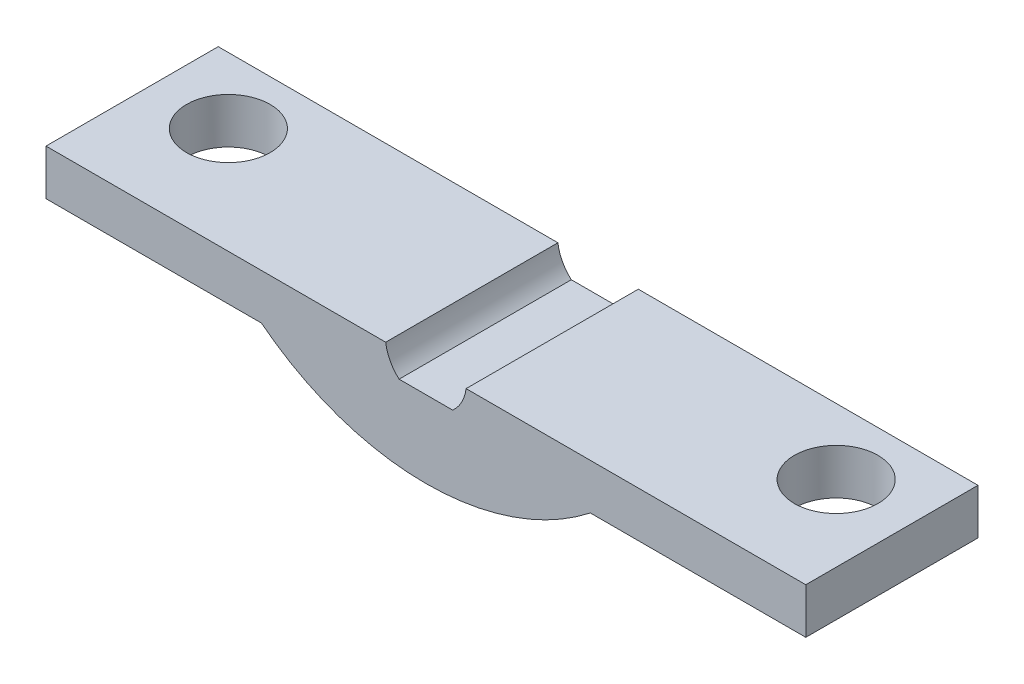
ISO-10303-21;
HEADER;
FILE_DESCRIPTION(('STEP AP214'),'2;1');
FILE_NAME('part.step','',(''),(''),'','','');
FILE_SCHEMA(('AUTOMOTIVE_DESIGN { 1 0 10303 214 1 1 1 1 }'));
ENDSEC;
DATA;
#1=APPLICATION_CONTEXT('core data for automotive mechanical design processes');
#2=APPLICATION_PROTOCOL_DEFINITION('international standard','automotive_design',2000,#1);
#3=PRODUCT_CONTEXT('',#1,'mechanical');
#4=PRODUCT('Part','Part','',(#3));
#5=PRODUCT_RELATED_PRODUCT_CATEGORY('part','',(#4));
#6=PRODUCT_DEFINITION_FORMATION('','',#4);
#7=PRODUCT_DEFINITION_CONTEXT('part definition',#1,'design');
#8=PRODUCT_DEFINITION('design','',#6,#7);
#9=PRODUCT_DEFINITION_SHAPE('','',#8);
#10=(LENGTH_UNIT() NAMED_UNIT(*) SI_UNIT(.MILLI.,.METRE.));
#11=(NAMED_UNIT(*) PLANE_ANGLE_UNIT() SI_UNIT($,.RADIAN.));
#12=(NAMED_UNIT(*) SI_UNIT($,.STERADIAN.) SOLID_ANGLE_UNIT());
#13=UNCERTAINTY_MEASURE_WITH_UNIT(LENGTH_MEASURE(1.E-05),#10,'distance_accuracy_value','');
#14=(GEOMETRIC_REPRESENTATION_CONTEXT(3) GLOBAL_UNCERTAINTY_ASSIGNED_CONTEXT((#13)) GLOBAL_UNIT_ASSIGNED_CONTEXT((#10,
#11,#12)) REPRESENTATION_CONTEXT('',''));
#15=CARTESIAN_POINT('',(0.,0.,0.));
#16=DIRECTION('',(0.,0.,1.));
#17=DIRECTION('',(1.,0.,0.));
#18=AXIS2_PLACEMENT_3D('',#15,#16,#17);
#19=CARTESIAN_POINT('',(0.,31.4655203588068,-111.672646407854));
#20=DIRECTION('',(0.,0.,1.));
#21=DIRECTION('',(1.,0.,0.));
#22=AXIS2_PLACEMENT_3D('',#19,#20,#21);
#23=CYLINDRICAL_SURFACE('',#22,52.6655203587927);
#24=CARTESIAN_POINT('',(0.,31.4655203588068,-33.9999999999999));
#25=DIRECTION('',(0.,0.,1.));
#26=DIRECTION('',(1.,0.,0.));
#27=AXIS2_PLACEMENT_3D('',#24,#25,#26);
#28=CIRCLE('',#27,52.6655203587927);
#29=CARTESIAN_POINT('',(32.4694880778216,-9.99999999999976,-33.9999999999999));
#30=VERTEX_POINT('',#29);
#31=CARTESIAN_POINT('',(-32.4694880778215,-9.99999999999999,-33.9999999999999));
#32=VERTEX_POINT('',#31);
#33=EDGE_CURVE('E52',#30,#32,#28,.F.);
#34=ORIENTED_EDGE('',*,*,#33,.F.);
#35=DIRECTION('',(0.,0.,1.));
#36=VECTOR('',#35,1.);
#37=CARTESIAN_POINT('',(32.4694880778216,-9.99999999999976,-111.672646407854));
#38=LINE('',#37,#36);
#39=CARTESIAN_POINT('',(32.4694880778216,-9.99999999999976,0.));
#40=VERTEX_POINT('',#39);
#41=EDGE_CURVE('E207',#30,#40,#38,.T.);
#42=ORIENTED_EDGE('',*,*,#41,.T.);
#43=CARTESIAN_POINT('',(0.,31.4655203588068,0.));
#44=DIRECTION('',(0.,0.,1.));
#45=DIRECTION('',(-1.,0.,0.));
#46=AXIS2_PLACEMENT_3D('',#43,#44,#45);
#47=CIRCLE('',#46,52.6655203587927);
#48=CARTESIAN_POINT('',(-32.4694880778215,-9.99999999999999,0.));
#49=VERTEX_POINT('',#48);
#50=EDGE_CURVE('E178',#49,#40,#47,.T.);
#51=ORIENTED_EDGE('',*,*,#50,.F.);
#52=DIRECTION('',(0.,0.,1.));
#53=VECTOR('',#52,1.);
#54=CARTESIAN_POINT('',(-32.4694880778215,-9.99999999999999,-111.672646407854));
#55=LINE('',#54,#53);
#56=EDGE_CURVE('E162',#32,#49,#55,.T.);
#57=ORIENTED_EDGE('',*,*,#56,.F.);
#58=EDGE_LOOP('',(#34,#42,#51,#57));
#59=FACE_BOUND('',#58,.T.);
#60=ADVANCED_FACE('F44',(#59),#23,.T.);
#61=CARTESIAN_POINT('',(-32.4694880778215,-9.99999999999999,-111.672646407854));
#62=DIRECTION('',(0.,-1.,0.));
#63=DIRECTION('',(1.,0.,0.));
#64=AXIS2_PLACEMENT_3D('',#61,#62,#63);
#65=PLANE('',#64);
#66=CARTESIAN_POINT('',(-60.,-9.99999999999999,-21.));
#67=DIRECTION('',(0.,-1.,0.));
#68=DIRECTION('',(1.,0.,0.));
#69=AXIS2_PLACEMENT_3D('',#66,#67,#68);
#70=CIRCLE('',#69,8.25);
#71=CARTESIAN_POINT('',(-51.75,-9.99999999999999,-21.));
#72=VERTEX_POINT('',#71);
#73=EDGE_CURVE('E154',#72,#72,#70,.T.);
#74=ORIENTED_EDGE('',*,*,#73,.F.);
#75=EDGE_LOOP('',(#74));
#76=FACE_BOUND('',#75,.T.);
#77=DIRECTION('',(-1.,0.,0.));
#78=VECTOR('',#77,1.);
#79=CARTESIAN_POINT('',(-32.4694880778215,-9.99999999999999,-33.9999999999999));
#80=LINE('',#79,#78);
#81=CARTESIAN_POINT('',(-75.,-9.99999999999999,-33.9999999999999));
#82=VERTEX_POINT('',#81);
#83=EDGE_CURVE('E165',#32,#82,#80,.T.);
#84=ORIENTED_EDGE('',*,*,#83,.F.);
#85=ORIENTED_EDGE('',*,*,#56,.T.);
#86=DIRECTION('',(1.,0.,0.));
#87=VECTOR('',#86,1.);
#88=CARTESIAN_POINT('',(-32.4694880778215,-9.99999999999999,0.));
#89=LINE('',#88,#87);
#90=CARTESIAN_POINT('',(-75.,-9.99999999999999,0.));
#91=VERTEX_POINT('',#90);
#92=EDGE_CURVE('E175',#91,#49,#89,.T.);
#93=ORIENTED_EDGE('',*,*,#92,.F.);
#94=DIRECTION('',(0.,0.,1.));
#95=VECTOR('',#94,1.);
#96=CARTESIAN_POINT('',(-75.,-9.99999999999999,-111.672646407854));
#97=LINE('',#96,#95);
#98=EDGE_CURVE('E181',#82,#91,#97,.T.);
#99=ORIENTED_EDGE('',*,*,#98,.F.);
#100=EDGE_LOOP('',(#84,#85,#93,#99));
#101=FACE_BOUND('',#100,.T.);
#102=ADVANCED_FACE('F201',(#76,#101),#65,.T.);
#103=CARTESIAN_POINT('',(-75.,-0.99999999999999,-111.672646407854));
#104=DIRECTION('',(-1.,0.,0.));
#105=DIRECTION('',(0.,0.,1.));
#106=AXIS2_PLACEMENT_3D('',#103,#104,#105);
#107=PLANE('',#106);
#108=DIRECTION('',(0.,1.,0.));
#109=VECTOR('',#108,1.);
#110=CARTESIAN_POINT('',(-75.,-0.99999999999999,-33.9999999999999));
#111=LINE('',#110,#109);
#112=CARTESIAN_POINT('',(-75.,-0.99999999999999,-33.9999999999999));
#113=VERTEX_POINT('',#112);
#114=EDGE_CURVE('E64',#82,#113,#111,.T.);
#115=ORIENTED_EDGE('',*,*,#114,.F.);
#116=ORIENTED_EDGE('',*,*,#98,.T.);
#117=DIRECTION('',(0.,-1.,0.));
#118=VECTOR('',#117,1.);
#119=CARTESIAN_POINT('',(-75.,-0.99999999999999,0.));
#120=LINE('',#119,#118);
#121=CARTESIAN_POINT('',(-75.,-0.99999999999999,0.));
#122=VERTEX_POINT('',#121);
#123=EDGE_CURVE('E172',#122,#91,#120,.T.);
#124=ORIENTED_EDGE('',*,*,#123,.F.);
#125=DIRECTION('',(0.,0.,1.));
#126=VECTOR('',#125,1.);
#127=CARTESIAN_POINT('',(-75.,-0.99999999999999,-111.672646407854));
#128=LINE('',#127,#126);
#129=EDGE_CURVE('E183',#113,#122,#128,.T.);
#130=ORIENTED_EDGE('',*,*,#129,.F.);
#131=EDGE_LOOP('',(#115,#116,#124,#130));
#132=FACE_BOUND('',#131,.T.);
#133=ADVANCED_FACE('F197',(#132),#107,.T.);
#134=CARTESIAN_POINT('',(-7.9372539331829,-0.999999999999999,-111.672646407854));
#135=DIRECTION('',(0.,1.,0.));
#136=DIRECTION('',(-1.,0.,0.));
#137=AXIS2_PLACEMENT_3D('',#134,#135,#136);
#138=PLANE('',#137);
#139=CARTESIAN_POINT('',(-60.,-0.99999999999999,-21.));
#140=DIRECTION('',(0.,1.,0.));
#141=DIRECTION('',(-1.,0.,0.));
#142=AXIS2_PLACEMENT_3D('',#139,#140,#141);
#143=CIRCLE('',#142,8.25);
#144=CARTESIAN_POINT('',(-68.25,-0.999999999999989,-21.));
#145=VERTEX_POINT('',#144);
#146=EDGE_CURVE('E130',#145,#145,#143,.F.);
#147=ORIENTED_EDGE('',*,*,#146,.T.);
#148=EDGE_LOOP('',(#147));
#149=FACE_BOUND('',#148,.T.);
#150=DIRECTION('',(1.,0.,0.));
#151=VECTOR('',#150,1.);
#152=CARTESIAN_POINT('',(-7.9372539331829,-0.999999999999999,-33.9999999999999));
#153=LINE('',#152,#151);
#154=CARTESIAN_POINT('',(-7.9372539331829,-0.999999999999999,-33.9999999999999));
#155=VERTEX_POINT('',#154);
#156=EDGE_CURVE('E59',#113,#155,#153,.T.);
#157=ORIENTED_EDGE('',*,*,#156,.F.);
#158=ORIENTED_EDGE('',*,*,#129,.T.);
#159=DIRECTION('',(-1.,0.,0.));
#160=VECTOR('',#159,1.);
#161=CARTESIAN_POINT('',(-7.9372539331829,-0.999999999999999,0.));
#162=LINE('',#161,#160);
#163=CARTESIAN_POINT('',(-7.9372539331829,-0.999999999999999,0.));
#164=VERTEX_POINT('',#163);
#165=EDGE_CURVE('E169',#164,#122,#162,.T.);
#166=ORIENTED_EDGE('',*,*,#165,.F.);
#167=DIRECTION('',(0.,0.,1.));
#168=VECTOR('',#167,1.);
#169=CARTESIAN_POINT('',(-7.9372539331829,-0.999999999999999,-111.672646407854));
#170=LINE('',#169,#168);
#171=EDGE_CURVE('E185',#155,#164,#170,.T.);
#172=ORIENTED_EDGE('',*,*,#171,.F.);
#173=EDGE_LOOP('',(#157,#158,#166,#172));
#174=FACE_BOUND('',#173,.T.);
#175=ADVANCED_FACE('F191',(#149,#174),#138,.T.);
#176=CARTESIAN_POINT('',(0.,0.,-111.672646407854));
#177=DIRECTION('',(0.,0.,1.));
#178=DIRECTION('',(1.,0.,0.));
#179=AXIS2_PLACEMENT_3D('',#176,#177,#178);
#180=CYLINDRICAL_SURFACE('',#179,7.99999999998921);
#181=CARTESIAN_POINT('',(0.,0.,-33.9999999999999));
#182=DIRECTION('',(0.,0.,1.));
#183=DIRECTION('',(1.,0.,0.));
#184=AXIS2_PLACEMENT_3D('',#181,#182,#183);
#185=CIRCLE('',#184,7.99999999998921);
#186=CARTESIAN_POINT('',(-5.29150262213566,-5.9999999999799,-33.9999999999999));
#187=VERTEX_POINT('',#186);
#188=EDGE_CURVE('E160',#155,#187,#185,.T.);
#189=ORIENTED_EDGE('',*,*,#188,.F.);
#190=ORIENTED_EDGE('',*,*,#171,.T.);
#191=CARTESIAN_POINT('',(0.,0.,0.));
#192=DIRECTION('',(0.,0.,-1.));
#193=DIRECTION('',(-1.,0.,0.));
#194=AXIS2_PLACEMENT_3D('',#191,#192,#193);
#195=CIRCLE('',#194,7.99999999998921);
#196=CARTESIAN_POINT('',(-5.29150262213566,-5.9999999999799,0.));
#197=VERTEX_POINT('',#196);
#198=EDGE_CURVE('E129',#197,#164,#195,.T.);
#199=ORIENTED_EDGE('',*,*,#198,.F.);
#200=DIRECTION('',(0.,0.,1.));
#201=VECTOR('',#200,1.);
#202=CARTESIAN_POINT('',(-5.29150262213566,-5.9999999999799,-111.672646407854));
#203=LINE('',#202,#201);
#204=EDGE_CURVE('E125',#187,#197,#203,.T.);
#205=ORIENTED_EDGE('',*,*,#204,.F.);
#206=EDGE_LOOP('',(#189,#190,#199,#205));
#207=FACE_BOUND('',#206,.T.);
#208=ADVANCED_FACE('F189',(#207),#180,.F.);
#209=CARTESIAN_POINT('',(0.,-5.99999999997181,-111.672646407854));
#210=DIRECTION('',(-1.52917200113342E-12,1.,0.));
#211=DIRECTION('',(-1.,-1.52917200113342E-12,0.));
#212=AXIS2_PLACEMENT_3D('',#209,#210,#211);
#213=PLANE('',#212);
#214=DIRECTION('',(1.,1.52917200113342E-12,0.));
#215=VECTOR('',#214,1.);
#216=CARTESIAN_POINT('',(0.,-5.99999999997181,-33.9999999999999));
#217=LINE('',#216,#215);
#218=CARTESIAN_POINT('',(5.2915026221357,-5.99999999997986,-33.9999999999999));
#219=VERTEX_POINT('',#218);
#220=EDGE_CURVE('E13',#187,#219,#217,.T.);
#221=ORIENTED_EDGE('',*,*,#220,.F.);
#222=ORIENTED_EDGE('',*,*,#204,.T.);
#223=DIRECTION('',(-1.,-1.52917200113342E-12,0.));
#224=VECTOR('',#223,1.);
#225=CARTESIAN_POINT('',(0.,-5.99999999997181,0.));
#226=LINE('',#225,#224);
#227=CARTESIAN_POINT('',(5.2915026221357,-5.99999999997986,0.));
#228=VERTEX_POINT('',#227);
#229=EDGE_CURVE('E118',#228,#197,#226,.T.);
#230=ORIENTED_EDGE('',*,*,#229,.F.);
#231=DIRECTION('',(0.,0.,1.));
#232=VECTOR('',#231,1.);
#233=CARTESIAN_POINT('',(5.2915026221357,-5.99999999997986,-111.672646407854));
#234=LINE('',#233,#232);
#235=EDGE_CURVE('E122',#219,#228,#234,.T.);
#236=ORIENTED_EDGE('',*,*,#235,.F.);
#237=EDGE_LOOP('',(#221,#222,#230,#236));
#238=FACE_BOUND('',#237,.T.);
#239=ADVANCED_FACE('F46',(#238),#213,.T.);
#240=CARTESIAN_POINT('',(0.,0.,0.));
#241=DIRECTION('',(0.,0.,-1.));
#242=DIRECTION('',(-1.,0.,0.));
#243=AXIS2_PLACEMENT_3D('',#240,#241,#242);
#244=PLANE('',#243);
#245=ORIENTED_EDGE('',*,*,#50,.T.);
#246=DIRECTION('',(-1.,0.,0.));
#247=VECTOR('',#246,1.);
#248=CARTESIAN_POINT('',(32.4694880778216,-9.99999999999976,0.));
#249=LINE('',#248,#247);
#250=CARTESIAN_POINT('',(75.0000000000001,-9.99999999999944,0.));
#251=VERTEX_POINT('',#250);
#252=EDGE_CURVE('E145',#251,#40,#249,.T.);
#253=ORIENTED_EDGE('',*,*,#252,.F.);
#254=DIRECTION('',(0.,-1.,0.));
#255=VECTOR('',#254,1.);
#256=CARTESIAN_POINT('',(75.,-0.999999999999444,0.));
#257=LINE('',#256,#255);
#258=CARTESIAN_POINT('',(75.,-0.999999999999444,0.));
#259=VERTEX_POINT('',#258);
#260=EDGE_CURVE('E150',#259,#251,#257,.T.);
#261=ORIENTED_EDGE('',*,*,#260,.F.);
#262=DIRECTION('',(1.,0.,0.));
#263=VECTOR('',#262,1.);
#264=CARTESIAN_POINT('',(7.9372539331829,-0.999999999999942,0.));
#265=LINE('',#264,#263);
#266=CARTESIAN_POINT('',(7.9372539331829,-0.999999999999942,0.));
#267=VERTEX_POINT('',#266);
#268=EDGE_CURVE('E136',#267,#259,#265,.T.);
#269=ORIENTED_EDGE('',*,*,#268,.F.);
#270=CARTESIAN_POINT('',(0.,0.,0.));
#271=DIRECTION('',(0.,0.,1.));
#272=DIRECTION('',(1.,0.,0.));
#273=AXIS2_PLACEMENT_3D('',#270,#271,#272);
#274=CIRCLE('',#273,7.99999999998921);
#275=EDGE_CURVE('E133',#228,#267,#274,.T.);
#276=ORIENTED_EDGE('',*,*,#275,.F.);
#277=ORIENTED_EDGE('',*,*,#229,.T.);
#278=ORIENTED_EDGE('',*,*,#198,.T.);
#279=ORIENTED_EDGE('',*,*,#165,.T.);
#280=ORIENTED_EDGE('',*,*,#123,.T.);
#281=ORIENTED_EDGE('',*,*,#92,.T.);
#282=EDGE_LOOP('',(#245,#253,#261,#269,#276,#277,#278,#279,#280,#281));
#283=FACE_BOUND('',#282,.T.);
#284=ADVANCED_FACE('F134',(#283),#244,.F.);
#285=CARTESIAN_POINT('',(-7.99999999999956,0.,-33.9999999999999));
#286=DIRECTION('',(0.,0.,1.));
#287=DIRECTION('',(0.,1.,0.));
#288=AXIS2_PLACEMENT_3D('',#285,#286,#287);
#289=PLANE('',#288);
#290=ORIENTED_EDGE('',*,*,#220,.T.);
#291=CARTESIAN_POINT('',(0.,0.,-33.9999999999999));
#292=DIRECTION('',(0.,0.,-1.));
#293=DIRECTION('',(-1.,0.,0.));
#294=AXIS2_PLACEMENT_3D('',#291,#292,#293);
#295=CIRCLE('',#294,7.99999999998921);
#296=CARTESIAN_POINT('',(7.9372539331829,-0.999999999999942,-33.9999999999999));
#297=VERTEX_POINT('',#296);
#298=EDGE_CURVE('E143',#297,#219,#295,.T.);
#299=ORIENTED_EDGE('',*,*,#298,.F.);
#300=DIRECTION('',(-1.,0.,0.));
#301=VECTOR('',#300,1.);
#302=CARTESIAN_POINT('',(7.9372539331829,-0.999999999999942,-33.9999999999999));
#303=LINE('',#302,#301);
#304=CARTESIAN_POINT('',(75.,-0.999999999999444,-33.9999999999999));
#305=VERTEX_POINT('',#304);
#306=EDGE_CURVE('E226',#305,#297,#303,.T.);
#307=ORIENTED_EDGE('',*,*,#306,.F.);
#308=DIRECTION('',(0.,1.,0.));
#309=VECTOR('',#308,1.);
#310=CARTESIAN_POINT('',(75.,-0.999999999999444,-33.9999999999999));
#311=LINE('',#310,#309);
#312=CARTESIAN_POINT('',(75.0000000000001,-9.99999999999944,-33.9999999999999));
#313=VERTEX_POINT('',#312);
#314=EDGE_CURVE('E224',#313,#305,#311,.T.);
#315=ORIENTED_EDGE('',*,*,#314,.F.);
#316=DIRECTION('',(1.,0.,0.));
#317=VECTOR('',#316,1.);
#318=CARTESIAN_POINT('',(32.4694880778216,-9.99999999999976,-33.9999999999999));
#319=LINE('',#318,#317);
#320=EDGE_CURVE('E157',#30,#313,#319,.T.);
#321=ORIENTED_EDGE('',*,*,#320,.F.);
#322=ORIENTED_EDGE('',*,*,#33,.T.);
#323=ORIENTED_EDGE('',*,*,#83,.T.);
#324=ORIENTED_EDGE('',*,*,#114,.T.);
#325=ORIENTED_EDGE('',*,*,#156,.T.);
#326=ORIENTED_EDGE('',*,*,#188,.T.);
#327=EDGE_LOOP('',(#290,#299,#307,#315,#321,#322,#323,#324,#325,#326));
#328=FACE_BOUND('',#327,.T.);
#329=ADVANCED_FACE('F249',(#328),#289,.F.);
#330=CARTESIAN_POINT('',(-60.,22.3345237791561,-21.));
#331=DIRECTION('',(0.,-1.,0.));
#332=DIRECTION('',(1.,0.,0.));
#333=AXIS2_PLACEMENT_3D('',#330,#331,#332);
#334=CYLINDRICAL_SURFACE('',#333,8.25);
#335=ORIENTED_EDGE('',*,*,#73,.T.);
#336=EDGE_LOOP('',(#335));
#337=FACE_BOUND('',#336,.T.);
#338=ORIENTED_EDGE('',*,*,#146,.F.);
#339=EDGE_LOOP('',(#338));
#340=FACE_BOUND('',#339,.T.);
#341=ADVANCED_FACE('F255',(#337,#340),#334,.F.);
#342=CARTESIAN_POINT('',(32.4694880778216,-9.99999999999976,-111.672646407854));
#343=DIRECTION('',(0.,-1.,0.));
#344=DIRECTION('',(-1.,0.,0.));
#345=AXIS2_PLACEMENT_3D('',#342,#343,#344);
#346=PLANE('',#345);
#347=CARTESIAN_POINT('',(60.0000000000001,-9.99999999999955,-21.));
#348=DIRECTION('',(0.,1.,0.));
#349=DIRECTION('',(-1.,0.,0.));
#350=AXIS2_PLACEMENT_3D('',#347,#348,#349);
#351=CIRCLE('',#350,8.25);
#352=CARTESIAN_POINT('',(51.75,-9.99999999999961,-21.));
#353=VERTEX_POINT('',#352);
#354=EDGE_CURVE('E232',#353,#353,#351,.T.);
#355=ORIENTED_EDGE('',*,*,#354,.T.);
#356=EDGE_LOOP('',(#355));
#357=FACE_BOUND('',#356,.T.);
#358=ORIENTED_EDGE('',*,*,#320,.T.);
#359=DIRECTION('',(0.,0.,1.));
#360=VECTOR('',#359,1.);
#361=CARTESIAN_POINT('',(75.0000000000001,-9.99999999999944,-111.672646407854));
#362=LINE('',#361,#360);
#363=EDGE_CURVE('E214',#313,#251,#362,.T.);
#364=ORIENTED_EDGE('',*,*,#363,.T.);
#365=ORIENTED_EDGE('',*,*,#252,.T.);
#366=ORIENTED_EDGE('',*,*,#41,.F.);
#367=EDGE_LOOP('',(#358,#364,#365,#366));
#368=FACE_BOUND('',#367,.T.);
#369=ADVANCED_FACE('F212',(#357,#368),#346,.T.);
#370=CARTESIAN_POINT('',(75.,-0.999999999999444,-111.672646407854));
#371=DIRECTION('',(1.,0.,0.));
#372=DIRECTION('',(0.,0.,1.));
#373=AXIS2_PLACEMENT_3D('',#370,#371,#372);
#374=PLANE('',#373);
#375=ORIENTED_EDGE('',*,*,#314,.T.);
#376=DIRECTION('',(0.,0.,1.));
#377=VECTOR('',#376,1.);
#378=CARTESIAN_POINT('',(75.,-0.999999999999444,-111.672646407854));
#379=LINE('',#378,#377);
#380=EDGE_CURVE('E147',#305,#259,#379,.T.);
#381=ORIENTED_EDGE('',*,*,#380,.T.);
#382=ORIENTED_EDGE('',*,*,#260,.T.);
#383=ORIENTED_EDGE('',*,*,#363,.F.);
#384=EDGE_LOOP('',(#375,#381,#382,#383));
#385=FACE_BOUND('',#384,.T.);
#386=ADVANCED_FACE('F246',(#385),#374,.T.);
#387=CARTESIAN_POINT('',(7.9372539331829,-0.999999999999942,-111.672646407854));
#388=DIRECTION('',(0.,1.,0.));
#389=DIRECTION('',(1.,0.,0.));
#390=AXIS2_PLACEMENT_3D('',#387,#388,#389);
#391=PLANE('',#390);
#392=CARTESIAN_POINT('',(60.,-0.999999999999552,-21.));
#393=DIRECTION('',(0.,-1.,0.));
#394=DIRECTION('',(1.,0.,0.));
#395=AXIS2_PLACEMENT_3D('',#392,#393,#394);
#396=CIRCLE('',#395,8.25);
#397=CARTESIAN_POINT('',(68.25,-0.99999999999949,-21.));
#398=VERTEX_POINT('',#397);
#399=EDGE_CURVE('E140',#398,#398,#396,.F.);
#400=ORIENTED_EDGE('',*,*,#399,.F.);
#401=EDGE_LOOP('',(#400));
#402=FACE_BOUND('',#401,.T.);
#403=ORIENTED_EDGE('',*,*,#306,.T.);
#404=DIRECTION('',(0.,0.,1.));
#405=VECTOR('',#404,1.);
#406=CARTESIAN_POINT('',(7.9372539331829,-0.999999999999942,-111.672646407854));
#407=LINE('',#406,#405);
#408=EDGE_CURVE('E144',#297,#267,#407,.T.);
#409=ORIENTED_EDGE('',*,*,#408,.T.);
#410=ORIENTED_EDGE('',*,*,#268,.T.);
#411=ORIENTED_EDGE('',*,*,#380,.F.);
#412=EDGE_LOOP('',(#403,#409,#410,#411));
#413=FACE_BOUND('',#412,.T.);
#414=ADVANCED_FACE('F243',(#402,#413),#391,.T.);
#415=CARTESIAN_POINT('',(0.,0.,-111.672646407854));
#416=DIRECTION('',(0.,0.,1.));
#417=DIRECTION('',(-1.,0.,0.));
#418=AXIS2_PLACEMENT_3D('',#415,#416,#417);
#419=CYLINDRICAL_SURFACE('',#418,7.99999999998921);
#420=ORIENTED_EDGE('',*,*,#298,.T.);
#421=ORIENTED_EDGE('',*,*,#235,.T.);
#422=ORIENTED_EDGE('',*,*,#275,.T.);
#423=ORIENTED_EDGE('',*,*,#408,.F.);
#424=EDGE_LOOP('',(#420,#421,#422,#423));
#425=FACE_BOUND('',#424,.T.);
#426=ADVANCED_FACE('F142',(#425),#419,.F.);
#427=CARTESIAN_POINT('',(59.9999999999998,22.3345237791565,-21.));
#428=DIRECTION('',(0.,-1.,0.));
#429=DIRECTION('',(-1.,0.,0.));
#430=AXIS2_PLACEMENT_3D('',#427,#428,#429);
#431=CYLINDRICAL_SURFACE('',#430,8.25);
#432=ORIENTED_EDGE('',*,*,#354,.F.);
#433=EDGE_LOOP('',(#432));
#434=FACE_BOUND('',#433,.T.);
#435=ORIENTED_EDGE('',*,*,#399,.T.);
#436=EDGE_LOOP('',(#435));
#437=FACE_BOUND('',#436,.T.);
#438=ADVANCED_FACE('F237',(#434,#437),#431,.F.);
#439=CLOSED_SHELL('',(#60,#102,#133,#175,#208,#239,#284,#329,#341,#369,#386,#414,#426,#438));
#440=MANIFOLD_SOLID_BREP('B2',#439);
#441=ADVANCED_BREP_SHAPE_REPRESENTATION('',(#18,#440),#14);
#442=SHAPE_DEFINITION_REPRESENTATION(#9,#441);
ENDSEC;
END-ISO-10303-21;
